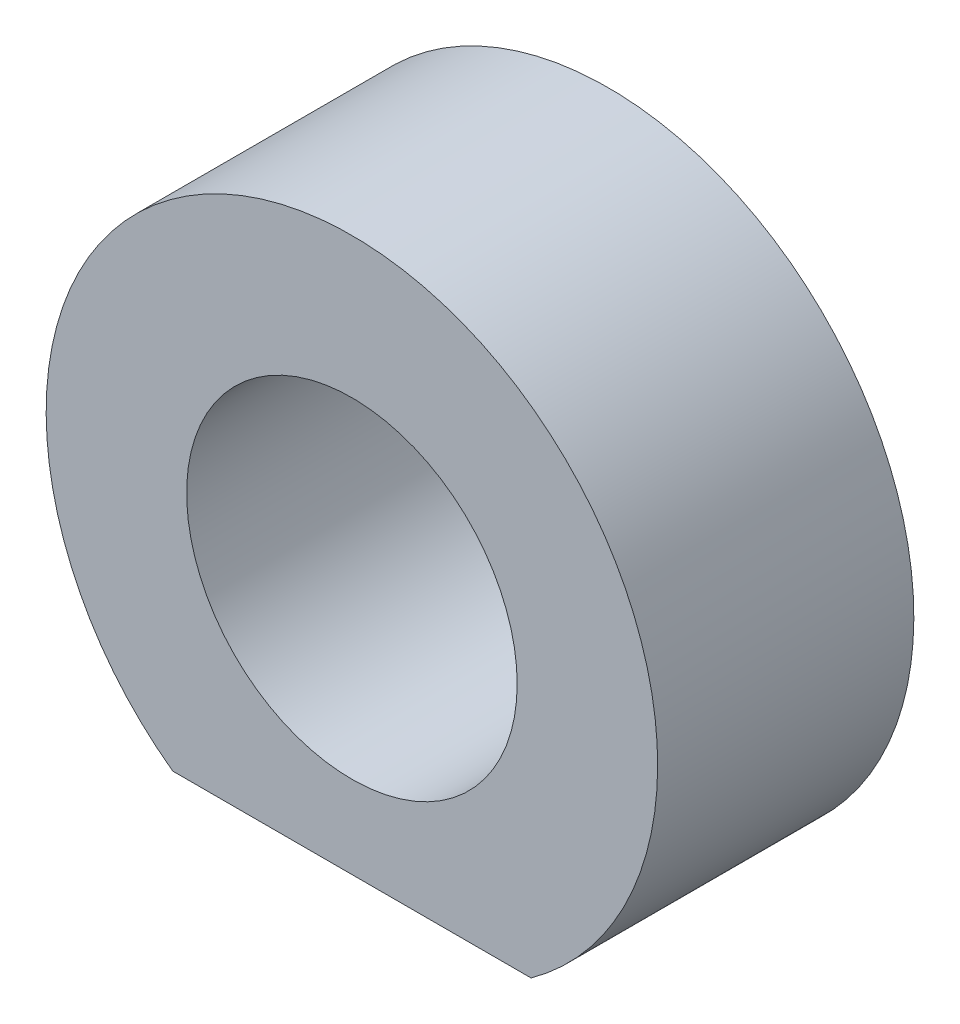
ISO-10303-21;
HEADER;
FILE_DESCRIPTION(('STEP AP214'),'2;1');
FILE_NAME('part.step','',(''),(''),'','','');
FILE_SCHEMA(('AUTOMOTIVE_DESIGN { 1 0 10303 214 1 1 1 1 }'));
ENDSEC;
DATA;
#1=APPLICATION_CONTEXT('core data for automotive mechanical design processes');
#2=APPLICATION_PROTOCOL_DEFINITION('international standard','automotive_design',2000,#1);
#3=PRODUCT_CONTEXT('',#1,'mechanical');
#4=PRODUCT('Part','Part','',(#3));
#5=PRODUCT_RELATED_PRODUCT_CATEGORY('part','',(#4));
#6=PRODUCT_DEFINITION_FORMATION('','',#4);
#7=PRODUCT_DEFINITION_CONTEXT('part definition',#1,'design');
#8=PRODUCT_DEFINITION('design','',#6,#7);
#9=PRODUCT_DEFINITION_SHAPE('','',#8);
#10=(LENGTH_UNIT() NAMED_UNIT(*) SI_UNIT(.MILLI.,.METRE.));
#11=(NAMED_UNIT(*) PLANE_ANGLE_UNIT() SI_UNIT($,.RADIAN.));
#12=(NAMED_UNIT(*) SI_UNIT($,.STERADIAN.) SOLID_ANGLE_UNIT());
#13=UNCERTAINTY_MEASURE_WITH_UNIT(LENGTH_MEASURE(1.E-05),#10,'distance_accuracy_value','');
#14=(GEOMETRIC_REPRESENTATION_CONTEXT(3) GLOBAL_UNCERTAINTY_ASSIGNED_CONTEXT((#13)) GLOBAL_UNIT_ASSIGNED_CONTEXT((#10,
#11,#12)) REPRESENTATION_CONTEXT('',''));
#15=CARTESIAN_POINT('',(0.,0.,0.));
#16=DIRECTION('',(0.,0.,1.));
#17=DIRECTION('',(1.,0.,0.));
#18=AXIS2_PLACEMENT_3D('',#15,#16,#17);
#19=CARTESIAN_POINT('',(0.,0.,15.5));
#20=DIRECTION('',(0.,0.,1.));
#21=DIRECTION('',(1.,0.,0.));
#22=AXIS2_PLACEMENT_3D('',#19,#20,#21);
#23=PLANE('',#22);
#24=CARTESIAN_POINT('',(0.,0.,15.5));
#25=DIRECTION('',(0.,0.,1.));
#26=DIRECTION('',(1.,0.,0.));
#27=AXIS2_PLACEMENT_3D('',#24,#25,#26);
#28=CIRCLE('',#27,18.5);
#29=CARTESIAN_POINT('',(10.8420431653817,-14.99,15.5));
#30=VERTEX_POINT('',#29);
#31=CARTESIAN_POINT('',(-10.8420431653817,-14.99,15.5));
#32=VERTEX_POINT('',#31);
#33=EDGE_CURVE('E64',#30,#32,#28,.T.);
#34=ORIENTED_EDGE('',*,*,#33,.T.);
#35=DIRECTION('',(1.,0.,0.));
#36=VECTOR('',#35,1.);
#37=CARTESIAN_POINT('',(-10.8420431653817,-14.99,15.5));
#38=LINE('',#37,#36);
#39=EDGE_CURVE('E49',#32,#30,#38,.T.);
#40=ORIENTED_EDGE('',*,*,#39,.T.);
#41=EDGE_LOOP('',(#34,#40));
#42=FACE_BOUND('',#41,.T.);
#43=CARTESIAN_POINT('',(0.,0.,15.5));
#44=DIRECTION('',(0.,0.,1.));
#45=DIRECTION('',(1.,0.,0.));
#46=AXIS2_PLACEMENT_3D('',#43,#44,#45);
#47=CIRCLE('',#46,10.);
#48=CARTESIAN_POINT('',(10.,0.,15.5));
#49=VERTEX_POINT('',#48);
#50=EDGE_CURVE('E70',#49,#49,#47,.T.);
#51=ORIENTED_EDGE('',*,*,#50,.F.);
#52=EDGE_LOOP('',(#51));
#53=FACE_BOUND('',#52,.T.);
#54=ADVANCED_FACE('F33',(#42,#53),#23,.T.);
#55=CARTESIAN_POINT('',(0.,0.,0.));
#56=DIRECTION('',(0.,0.,1.));
#57=DIRECTION('',(1.,0.,0.));
#58=AXIS2_PLACEMENT_3D('',#55,#56,#57);
#59=PLANE('',#58);
#60=CARTESIAN_POINT('',(0.,0.,0.));
#61=DIRECTION('',(0.,0.,1.));
#62=DIRECTION('',(1.,0.,0.));
#63=AXIS2_PLACEMENT_3D('',#60,#61,#62);
#64=CIRCLE('',#63,18.5);
#65=CARTESIAN_POINT('',(10.8420431653817,-14.99,0.));
#66=VERTEX_POINT('',#65);
#67=CARTESIAN_POINT('',(-10.8420431653817,-14.99,0.));
#68=VERTEX_POINT('',#67);
#69=EDGE_CURVE('E65',#66,#68,#64,.T.);
#70=ORIENTED_EDGE('',*,*,#69,.F.);
#71=DIRECTION('',(1.,0.,0.));
#72=VECTOR('',#71,1.);
#73=CARTESIAN_POINT('',(-10.8420431653817,-14.99,0.));
#74=LINE('',#73,#72);
#75=EDGE_CURVE('E57',#68,#66,#74,.T.);
#76=ORIENTED_EDGE('',*,*,#75,.F.);
#77=EDGE_LOOP('',(#70,#76));
#78=FACE_BOUND('',#77,.T.);
#79=CARTESIAN_POINT('',(0.,0.,0.));
#80=DIRECTION('',(0.,0.,1.));
#81=DIRECTION('',(1.,0.,0.));
#82=AXIS2_PLACEMENT_3D('',#79,#80,#81);
#83=CIRCLE('',#82,10.);
#84=CARTESIAN_POINT('',(10.,0.,0.));
#85=VERTEX_POINT('',#84);
#86=EDGE_CURVE('E73',#85,#85,#83,.T.);
#87=ORIENTED_EDGE('',*,*,#86,.T.);
#88=EDGE_LOOP('',(#87));
#89=FACE_BOUND('',#88,.T.);
#90=ADVANCED_FACE('F68',(#78,#89),#59,.F.);
#91=CARTESIAN_POINT('',(0.,0.,15.5));
#92=DIRECTION('',(0.,0.,-1.));
#93=DIRECTION('',(-1.,0.,0.));
#94=AXIS2_PLACEMENT_3D('',#91,#92,#93);
#95=CYLINDRICAL_SURFACE('',#94,18.5);
#96=ORIENTED_EDGE('',*,*,#69,.T.);
#97=DIRECTION('',(0.,0.,-1.));
#98=VECTOR('',#97,1.);
#99=CARTESIAN_POINT('',(-10.8420431653817,-14.99,15.5));
#100=LINE('',#99,#98);
#101=EDGE_CURVE('E11',#32,#68,#100,.T.);
#102=ORIENTED_EDGE('',*,*,#101,.F.);
#103=ORIENTED_EDGE('',*,*,#33,.F.);
#104=DIRECTION('',(0.,0.,-1.));
#105=VECTOR('',#104,1.);
#106=CARTESIAN_POINT('',(10.8420431653817,-14.99,15.5));
#107=LINE('',#106,#105);
#108=EDGE_CURVE('E42',#30,#66,#107,.T.);
#109=ORIENTED_EDGE('',*,*,#108,.T.);
#110=EDGE_LOOP('',(#96,#102,#103,#109));
#111=FACE_BOUND('',#110,.T.);
#112=ADVANCED_FACE('F35',(#111),#95,.T.);
#113=CARTESIAN_POINT('',(-10.8420431653817,-14.99,15.5));
#114=DIRECTION('',(0.,1.,0.));
#115=DIRECTION('',(0.,0.,1.));
#116=AXIS2_PLACEMENT_3D('',#113,#114,#115);
#117=PLANE('',#116);
#118=ORIENTED_EDGE('',*,*,#75,.T.);
#119=ORIENTED_EDGE('',*,*,#108,.F.);
#120=ORIENTED_EDGE('',*,*,#39,.F.);
#121=ORIENTED_EDGE('',*,*,#101,.T.);
#122=EDGE_LOOP('',(#118,#119,#120,#121));
#123=FACE_BOUND('',#122,.T.);
#124=ADVANCED_FACE('F60',(#123),#117,.F.);
#125=CARTESIAN_POINT('',(0.,0.,15.5));
#126=DIRECTION('',(0.,0.,-1.));
#127=DIRECTION('',(-1.,0.,0.));
#128=AXIS2_PLACEMENT_3D('',#125,#126,#127);
#129=CYLINDRICAL_SURFACE('',#128,10.);
#130=ORIENTED_EDGE('',*,*,#50,.T.);
#131=EDGE_LOOP('',(#130));
#132=FACE_BOUND('',#131,.T.);
#133=ORIENTED_EDGE('',*,*,#86,.F.);
#134=EDGE_LOOP('',(#133));
#135=FACE_BOUND('',#134,.T.);
#136=ADVANCED_FACE('F81',(#132,#135),#129,.F.);
#137=CLOSED_SHELL('',(#54,#90,#112,#124,#136));
#138=MANIFOLD_SOLID_BREP('B2',#137);
#139=ADVANCED_BREP_SHAPE_REPRESENTATION('',(#18,#138),#14);
#140=SHAPE_DEFINITION_REPRESENTATION(#9,#139);
ENDSEC;
END-ISO-10303-21;
